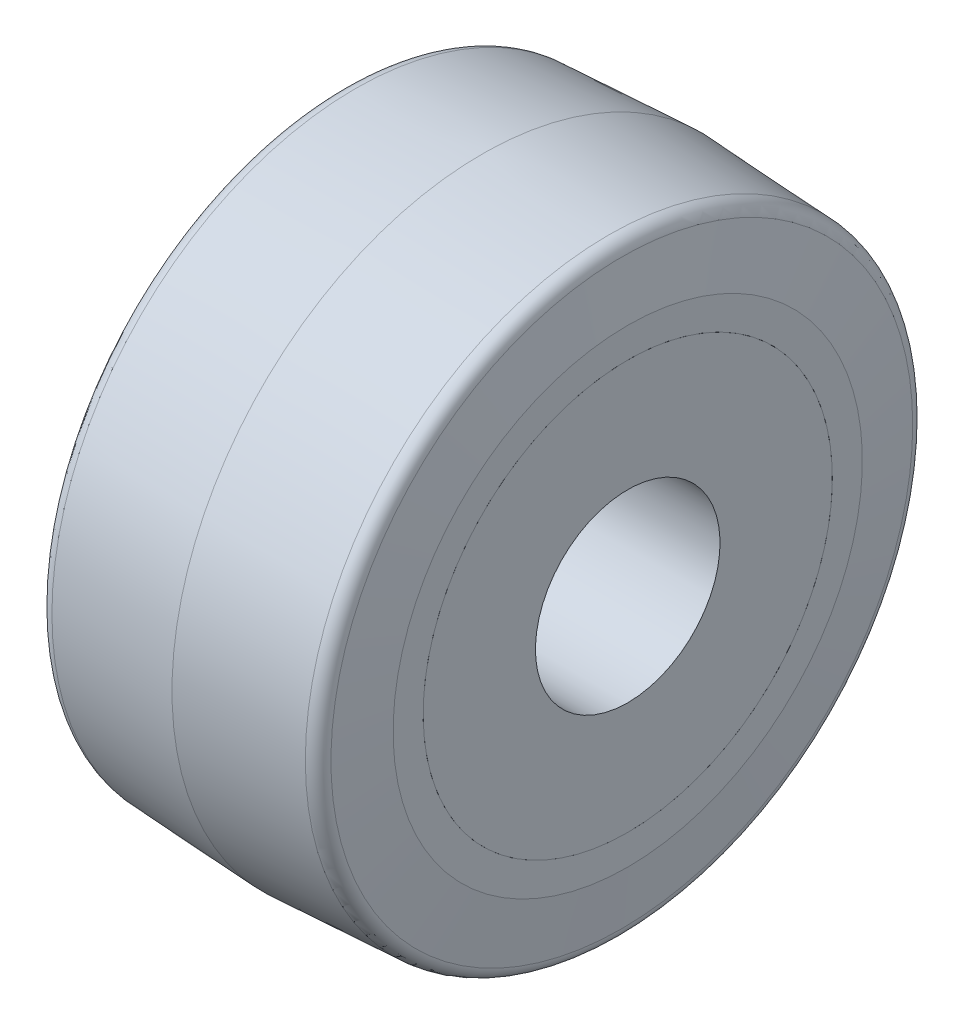
ISO-10303-21;
HEADER;
FILE_DESCRIPTION(('STEP AP214'),'2;1');
FILE_NAME('part.step','',(''),(''),'','','');
FILE_SCHEMA(('AUTOMOTIVE_DESIGN { 1 0 10303 214 1 1 1 1 }'));
ENDSEC;
DATA;
#1=APPLICATION_CONTEXT('core data for automotive mechanical design processes');
#2=APPLICATION_PROTOCOL_DEFINITION('international standard','automotive_design',2000,#1);
#3=PRODUCT_CONTEXT('',#1,'mechanical');
#4=PRODUCT('Part','Part','',(#3));
#5=PRODUCT_RELATED_PRODUCT_CATEGORY('part','',(#4));
#6=PRODUCT_DEFINITION_FORMATION('','',#4);
#7=PRODUCT_DEFINITION_CONTEXT('part definition',#1,'design');
#8=PRODUCT_DEFINITION('design','',#6,#7);
#9=PRODUCT_DEFINITION_SHAPE('','',#8);
#10=(LENGTH_UNIT() NAMED_UNIT(*) SI_UNIT(.MILLI.,.METRE.));
#11=(NAMED_UNIT(*) PLANE_ANGLE_UNIT() SI_UNIT($,.RADIAN.));
#12=(NAMED_UNIT(*) SI_UNIT($,.STERADIAN.) SOLID_ANGLE_UNIT());
#13=UNCERTAINTY_MEASURE_WITH_UNIT(LENGTH_MEASURE(1.E-05),#10,'distance_accuracy_value','');
#14=(GEOMETRIC_REPRESENTATION_CONTEXT(3) GLOBAL_UNCERTAINTY_ASSIGNED_CONTEXT((#13)) GLOBAL_UNIT_ASSIGNED_CONTEXT((#10,
#11,#12)) REPRESENTATION_CONTEXT('',''));
#15=CARTESIAN_POINT('',(0.,0.,0.));
#16=DIRECTION('',(0.,0.,1.));
#17=DIRECTION('',(1.,0.,0.));
#18=AXIS2_PLACEMENT_3D('',#15,#16,#17);
#19=CARTESIAN_POINT('',(-72.5714285714286,0.,0.));
#20=DIRECTION('',(-1.,0.,0.));
#21=DIRECTION('',(0.,0.,1.));
#22=AXIS2_PLACEMENT_3D('',#19,#20,#21);
#23=CYLINDRICAL_SURFACE('',#22,15.1257);
#24=CARTESIAN_POINT('',(23.8843486314588,0.,0.));
#25=DIRECTION('',(-1.,0.,0.));
#26=DIRECTION('',(0.,-1.,0.));
#27=AXIS2_PLACEMENT_3D('',#24,#25,#26);
#28=CIRCLE('',#27,15.1257);
#29=CARTESIAN_POINT('',(23.8843486314588,-15.1257,0.));
#30=VERTEX_POINT('',#29);
#31=EDGE_CURVE('E63',#30,#30,#28,.F.);
#32=ORIENTED_EDGE('',*,*,#31,.T.);
#33=EDGE_LOOP('',(#32));
#34=FACE_BOUND('',#33,.T.);
#35=CARTESIAN_POINT('',(-23.8843486314588,0.,0.));
#36=DIRECTION('',(1.,0.,0.));
#37=DIRECTION('',(0.,0.,-1.));
#38=AXIS2_PLACEMENT_3D('',#35,#36,#37);
#39=CIRCLE('',#38,15.1257);
#40=CARTESIAN_POINT('',(-23.8843486314588,0.,-15.1257));
#41=VERTEX_POINT('',#40);
#42=EDGE_CURVE('E54',#41,#41,#39,.F.);
#43=ORIENTED_EDGE('',*,*,#42,.T.);
#44=EDGE_LOOP('',(#43));
#45=FACE_BOUND('',#44,.T.);
#46=ADVANCED_FACE('F39',(#34,#45),#23,.F.);
#47=CARTESIAN_POINT('',(-72.5714285714286,0.,0.));
#48=DIRECTION('',(-1.,0.,0.));
#49=DIRECTION('',(0.,0.,1.));
#50=AXIS2_PLACEMENT_3D('',#47,#48,#49);
#51=CYLINDRICAL_SURFACE('',#50,33.528);
#52=CARTESIAN_POINT('',(23.8843486314588,0.,0.));
#53=DIRECTION('',(-1.,0.,0.));
#54=DIRECTION('',(0.,-1.,0.));
#55=AXIS2_PLACEMENT_3D('',#52,#53,#54);
#56=CIRCLE('',#55,33.528);
#57=CARTESIAN_POINT('',(23.8843486314588,-33.528,0.));
#58=VERTEX_POINT('',#57);
#59=EDGE_CURVE('E42',#58,#58,#56,.F.);
#60=ORIENTED_EDGE('',*,*,#59,.F.);
#61=EDGE_LOOP('',(#60));
#62=FACE_BOUND('',#61,.T.);
#63=CARTESIAN_POINT('',(19.05,0.,0.));
#64=DIRECTION('',(-1.,0.,0.));
#65=DIRECTION('',(0.,0.,1.));
#66=AXIS2_PLACEMENT_3D('',#63,#64,#65);
#67=CIRCLE('',#66,33.528);
#68=CARTESIAN_POINT('',(19.05,0.,33.528));
#69=VERTEX_POINT('',#68);
#70=EDGE_CURVE('E59',#69,#69,#67,.F.);
#71=ORIENTED_EDGE('',*,*,#70,.T.);
#72=EDGE_LOOP('',(#71));
#73=FACE_BOUND('',#72,.T.);
#74=ADVANCED_FACE('F76',(#62,#73),#51,.T.);
#75=CARTESIAN_POINT('',(-72.5714285714286,0.,0.));
#76=DIRECTION('',(-1.,0.,0.));
#77=DIRECTION('',(0.,0.,1.));
#78=AXIS2_PLACEMENT_3D('',#75,#76,#77);
#79=CYLINDRICAL_SURFACE('',#78,33.528);
#80=CARTESIAN_POINT('',(-23.8843486314588,0.,0.));
#81=DIRECTION('',(1.,0.,0.));
#82=DIRECTION('',(0.,0.,-1.));
#83=AXIS2_PLACEMENT_3D('',#80,#81,#82);
#84=CIRCLE('',#83,33.528);
#85=CARTESIAN_POINT('',(-23.8843486314588,0.,-33.528));
#86=VERTEX_POINT('',#85);
#87=EDGE_CURVE('E61',#86,#86,#84,.F.);
#88=ORIENTED_EDGE('',*,*,#87,.F.);
#89=EDGE_LOOP('',(#88));
#90=FACE_BOUND('',#89,.T.);
#91=CARTESIAN_POINT('',(-19.05,0.,0.));
#92=DIRECTION('',(-1.,0.,0.));
#93=DIRECTION('',(0.,0.,1.));
#94=AXIS2_PLACEMENT_3D('',#91,#92,#93);
#95=CIRCLE('',#94,33.528);
#96=CARTESIAN_POINT('',(-19.05,0.,33.528));
#97=VERTEX_POINT('',#96);
#98=EDGE_CURVE('E51',#97,#97,#95,.T.);
#99=ORIENTED_EDGE('',*,*,#98,.T.);
#100=EDGE_LOOP('',(#99));
#101=FACE_BOUND('',#100,.T.);
#102=ADVANCED_FACE('F79',(#90,#101),#79,.T.);
#103=CARTESIAN_POINT('',(19.05,41.148,0.));
#104=DIRECTION('',(-1.,0.,0.));
#105=DIRECTION('',(0.,0.,1.));
#106=AXIS2_PLACEMENT_3D('',#103,#104,#105);
#107=PLANE('',#106);
#108=ORIENTED_EDGE('',*,*,#70,.F.);
#109=EDGE_LOOP('',(#108));
#110=FACE_BOUND('',#109,.T.);
#111=CARTESIAN_POINT('',(19.05,0.,0.));
#112=DIRECTION('',(-1.,0.,0.));
#113=DIRECTION('',(0.,0.,1.));
#114=AXIS2_PLACEMENT_3D('',#111,#112,#113);
#115=CIRCLE('',#114,41.148);
#116=CARTESIAN_POINT('',(19.05,0.,41.148));
#117=VERTEX_POINT('',#116);
#118=EDGE_CURVE('E46',#117,#117,#115,.T.);
#119=ORIENTED_EDGE('',*,*,#118,.F.);
#120=EDGE_LOOP('',(#119));
#121=FACE_BOUND('',#120,.T.);
#122=ADVANCED_FACE('F82',(#110,#121),#107,.F.);
#123=CARTESIAN_POINT('',(-19.05,33.528,0.));
#124=DIRECTION('',(1.,0.,0.));
#125=DIRECTION('',(0.,0.,-1.));
#126=AXIS2_PLACEMENT_3D('',#123,#124,#125);
#127=PLANE('',#126);
#128=CARTESIAN_POINT('',(-19.05,0.,0.));
#129=DIRECTION('',(-1.,0.,0.));
#130=DIRECTION('',(0.,0.,1.));
#131=AXIS2_PLACEMENT_3D('',#128,#129,#130);
#132=CIRCLE('',#131,41.148);
#133=CARTESIAN_POINT('',(-19.05,0.,41.148));
#134=VERTEX_POINT('',#133);
#135=EDGE_CURVE('E11',#134,#134,#132,.F.);
#136=ORIENTED_EDGE('',*,*,#135,.F.);
#137=EDGE_LOOP('',(#136));
#138=FACE_BOUND('',#137,.T.);
#139=ORIENTED_EDGE('',*,*,#98,.F.);
#140=EDGE_LOOP('',(#139));
#141=FACE_BOUND('',#140,.T.);
#142=ADVANCED_FACE('F85',(#138,#141),#127,.F.);
#143=CARTESIAN_POINT('',(-72.5714285714286,0.,0.));
#144=DIRECTION('',(-1.,0.,0.));
#145=DIRECTION('',(0.,0.,1.));
#146=AXIS2_PLACEMENT_3D('',#143,#144,#145);
#147=CYLINDRICAL_SURFACE('',#146,41.148);
#148=ORIENTED_EDGE('',*,*,#135,.T.);
#149=EDGE_LOOP('',(#148));
#150=FACE_BOUND('',#149,.T.);
#151=ORIENTED_EDGE('',*,*,#118,.T.);
#152=EDGE_LOOP('',(#151));
#153=FACE_BOUND('',#152,.T.);
#154=ADVANCED_FACE('F89',(#150,#153),#147,.T.);
#155=CARTESIAN_POINT('',(-23.8843486314588,47.4644417861219,-76.2));
#156=DIRECTION('',(1.,0.,0.));
#157=DIRECTION('',(0.,0.,-1.));
#158=AXIS2_PLACEMENT_3D('',#155,#156,#157);
#159=PLANE('',#158);
#160=ORIENTED_EDGE('',*,*,#87,.T.);
#161=EDGE_LOOP('',(#160));
#162=FACE_BOUND('',#161,.T.);
#163=ORIENTED_EDGE('',*,*,#42,.F.);
#164=EDGE_LOOP('',(#163));
#165=FACE_BOUND('',#164,.T.);
#166=ADVANCED_FACE('F91',(#162,#165),#159,.F.);
#167=CARTESIAN_POINT('',(23.8843486314588,58.9207626230882,-76.2));
#168=DIRECTION('',(-1.,0.,0.));
#169=DIRECTION('',(0.,-1.,0.));
#170=AXIS2_PLACEMENT_3D('',#167,#168,#169);
#171=PLANE('',#170);
#172=ORIENTED_EDGE('',*,*,#59,.T.);
#173=EDGE_LOOP('',(#172));
#174=FACE_BOUND('',#173,.T.);
#175=ORIENTED_EDGE('',*,*,#31,.F.);
#176=EDGE_LOOP('',(#175));
#177=FACE_BOUND('',#176,.T.);
#178=ADVANCED_FACE('F73',(#174,#177),#171,.F.);
#179=CLOSED_SHELL('',(#46,#74,#102,#122,#142,#154,#166,#178));
#180=MANIFOLD_SOLID_BREP('B2',#179);
#181=CARTESIAN_POINT('',(20.6418818876907,0.,0.));
#182=DIRECTION('',(1.,0.,0.));
#183=DIRECTION('',(0.,0.,-1.));
#184=AXIS2_PLACEMENT_3D('',#181,#182,#183);
#185=TOROIDAL_SURFACE('',#184,47.4290676270922,2.286);
#186=CARTESIAN_POINT('',(20.7615218836621,0.,0.));
#187=DIRECTION('',(1.,0.,0.));
#188=DIRECTION('',(0.,0.,-1.));
#189=AXIS2_PLACEMENT_3D('',#186,#187,#188);
#190=CIRCLE('',#189,49.7119347435411);
#191=CARTESIAN_POINT('',(20.7615218836621,0.,-49.7119347435411));
#192=VERTEX_POINT('',#191);
#193=EDGE_CURVE('E38',#192,#192,#190,.T.);
#194=ORIENTED_EDGE('',*,*,#193,.T.);
#195=EDGE_LOOP('',(#194));
#196=FACE_BOUND('',#195,.T.);
#197=CARTESIAN_POINT('',(22.9153589405026,0.,0.));
#198=DIRECTION('',(1.,0.,0.));
#199=DIRECTION('',(0.,0.,-1.));
#200=AXIS2_PLACEMENT_3D('',#197,#198,#199);
#201=CIRCLE('',#200,47.6680196941221);
#202=CARTESIAN_POINT('',(22.9153589405026,0.,-47.6680196941221));
#203=VERTEX_POINT('',#202);
#204=EDGE_CURVE('E192',#203,#203,#201,.T.);
#205=ORIENTED_EDGE('',*,*,#204,.F.);
#206=EDGE_LOOP('',(#205));
#207=FACE_BOUND('',#206,.T.);
#208=ADVANCED_FACE('F161',(#196,#207),#185,.T.);
#209=CARTESIAN_POINT('',(20.7615218836621,0.,0.));
#210=DIRECTION('',(-1.,0.,0.));
#211=DIRECTION('',(0.,0.,1.));
#212=AXIS2_PLACEMENT_3D('',#209,#210,#211);
#213=CONICAL_SURFACE('',#212,49.7119347435411,0.0523598775598232);
#214=CARTESIAN_POINT('',(0.,0.,0.));
#215=DIRECTION('',(1.,0.,0.));
#216=DIRECTION('',(0.,0.,-1.));
#217=AXIS2_PLACEMENT_3D('',#214,#215,#216);
#218=CIRCLE('',#217,50.8);
#219=CARTESIAN_POINT('',(0.,0.,-50.8));
#220=VERTEX_POINT('',#219);
#221=EDGE_CURVE('E168',#220,#220,#218,.T.);
#222=ORIENTED_EDGE('',*,*,#221,.T.);
#223=EDGE_LOOP('',(#222));
#224=FACE_BOUND('',#223,.T.);
#225=ORIENTED_EDGE('',*,*,#193,.F.);
#226=EDGE_LOOP('',(#225));
#227=FACE_BOUND('',#226,.T.);
#228=ADVANCED_FACE('F223',(#224,#227),#213,.T.);
#229=CARTESIAN_POINT('',(0.,0.,0.));
#230=DIRECTION('',(1.,0.,0.));
#231=DIRECTION('',(0.,0.,-1.));
#232=AXIS2_PLACEMENT_3D('',#229,#230,#231);
#233=CONICAL_SURFACE('',#232,50.8,0.0523598775598232);
#234=CARTESIAN_POINT('',(-20.7615218836621,0.,0.));
#235=DIRECTION('',(1.,0.,0.));
#236=DIRECTION('',(0.,0.,-1.));
#237=AXIS2_PLACEMENT_3D('',#234,#235,#236);
#238=CIRCLE('',#237,49.7119347435411);
#239=CARTESIAN_POINT('',(-20.7615218836621,0.,-49.7119347435411));
#240=VERTEX_POINT('',#239);
#241=EDGE_CURVE('E172',#240,#240,#238,.T.);
#242=ORIENTED_EDGE('',*,*,#241,.T.);
#243=EDGE_LOOP('',(#242));
#244=FACE_BOUND('',#243,.T.);
#245=ORIENTED_EDGE('',*,*,#221,.F.);
#246=EDGE_LOOP('',(#245));
#247=FACE_BOUND('',#246,.T.);
#248=ADVANCED_FACE('F227',(#244,#247),#233,.T.);
#249=CARTESIAN_POINT('',(-20.6418818876907,0.,0.));
#250=DIRECTION('',(1.,0.,0.));
#251=DIRECTION('',(0.,0.,-1.));
#252=AXIS2_PLACEMENT_3D('',#249,#250,#251);
#253=TOROIDAL_SURFACE('',#252,47.4290676270922,2.286);
#254=CARTESIAN_POINT('',(-22.9153589405026,0.,0.));
#255=DIRECTION('',(1.,0.,0.));
#256=DIRECTION('',(0.,0.,-1.));
#257=AXIS2_PLACEMENT_3D('',#254,#255,#256);
#258=CIRCLE('',#257,47.668019694122);
#259=CARTESIAN_POINT('',(-22.9153589405026,0.,-47.668019694122));
#260=VERTEX_POINT('',#259);
#261=EDGE_CURVE('E177',#260,#260,#258,.T.);
#262=ORIENTED_EDGE('',*,*,#261,.T.);
#263=EDGE_LOOP('',(#262));
#264=FACE_BOUND('',#263,.T.);
#265=ORIENTED_EDGE('',*,*,#241,.F.);
#266=EDGE_LOOP('',(#265));
#267=FACE_BOUND('',#266,.T.);
#268=ADVANCED_FACE('F234',(#264,#267),#253,.T.);
#269=CARTESIAN_POINT('',(-22.9153589405026,0.,0.));
#270=DIRECTION('',(1.,0.,0.));
#271=DIRECTION('',(0.,0.,-1.));
#272=AXIS2_PLACEMENT_3D('',#269,#270,#271);
#273=CONICAL_SURFACE('',#272,47.668019694122,1.46607657167524);
#274=CARTESIAN_POINT('',(-23.8843486314588,0.,0.));
#275=DIRECTION('',(-1.,0.,0.));
#276=DIRECTION('',(0.,0.,1.));
#277=AXIS2_PLACEMENT_3D('',#274,#275,#276);
#278=CIRCLE('',#277,38.4486986219801);
#279=CARTESIAN_POINT('',(-23.8843486314588,0.,38.4486986219801));
#280=VERTEX_POINT('',#279);
#281=EDGE_CURVE('E195',#280,#280,#278,.T.);
#282=ORIENTED_EDGE('',*,*,#281,.F.);
#283=EDGE_LOOP('',(#282));
#284=FACE_BOUND('',#283,.T.);
#285=ORIENTED_EDGE('',*,*,#261,.F.);
#286=EDGE_LOOP('',(#285));
#287=FACE_BOUND('',#286,.T.);
#288=ADVANCED_FACE('F241',(#284,#287),#273,.T.);
#289=CARTESIAN_POINT('',(-25.4,0.,0.));
#290=DIRECTION('',(1.,0.,0.));
#291=DIRECTION('',(0.,0.,-1.));
#292=AXIS2_PLACEMENT_3D('',#289,#290,#291);
#293=CYLINDRICAL_SURFACE('',#292,33.528);
#294=CARTESIAN_POINT('',(-23.8843486314588,0.,0.));
#295=DIRECTION('',(1.,0.,0.));
#296=DIRECTION('',(0.,0.,-1.));
#297=AXIS2_PLACEMENT_3D('',#294,#295,#296);
#298=CIRCLE('',#297,33.528);
#299=CARTESIAN_POINT('',(-23.8843486314588,0.,-33.528));
#300=VERTEX_POINT('',#299);
#301=EDGE_CURVE('E164',#300,#300,#298,.T.);
#302=ORIENTED_EDGE('',*,*,#301,.F.);
#303=EDGE_LOOP('',(#302));
#304=FACE_BOUND('',#303,.T.);
#305=CARTESIAN_POINT('',(-19.05,0.,0.));
#306=DIRECTION('',(1.,0.,0.));
#307=DIRECTION('',(0.,0.,-1.));
#308=AXIS2_PLACEMENT_3D('',#305,#306,#307);
#309=CIRCLE('',#308,33.528);
#310=CARTESIAN_POINT('',(-19.05,0.,-33.528));
#311=VERTEX_POINT('',#310);
#312=EDGE_CURVE('E180',#311,#311,#309,.T.);
#313=ORIENTED_EDGE('',*,*,#312,.T.);
#314=EDGE_LOOP('',(#313));
#315=FACE_BOUND('',#314,.T.);
#316=ADVANCED_FACE('F245',(#304,#315),#293,.F.);
#317=CARTESIAN_POINT('',(-19.05,33.528,0.));
#318=DIRECTION('',(1.,0.,0.));
#319=DIRECTION('',(0.,0.,-1.));
#320=AXIS2_PLACEMENT_3D('',#317,#318,#319);
#321=PLANE('',#320);
#322=CARTESIAN_POINT('',(-19.05,0.,0.));
#323=DIRECTION('',(1.,0.,0.));
#324=DIRECTION('',(0.,0.,-1.));
#325=AXIS2_PLACEMENT_3D('',#322,#323,#324);
#326=CIRCLE('',#325,41.148);
#327=CARTESIAN_POINT('',(-19.05,0.,-41.148));
#328=VERTEX_POINT('',#327);
#329=EDGE_CURVE('E183',#328,#328,#326,.T.);
#330=ORIENTED_EDGE('',*,*,#329,.T.);
#331=EDGE_LOOP('',(#330));
#332=FACE_BOUND('',#331,.T.);
#333=ORIENTED_EDGE('',*,*,#312,.F.);
#334=EDGE_LOOP('',(#333));
#335=FACE_BOUND('',#334,.T.);
#336=ADVANCED_FACE('F249',(#332,#335),#321,.T.);
#337=CARTESIAN_POINT('',(-25.4,0.,0.));
#338=DIRECTION('',(1.,0.,0.));
#339=DIRECTION('',(0.,0.,-1.));
#340=AXIS2_PLACEMENT_3D('',#337,#338,#339);
#341=CYLINDRICAL_SURFACE('',#340,41.148);
#342=CARTESIAN_POINT('',(19.05,0.,0.));
#343=DIRECTION('',(1.,0.,0.));
#344=DIRECTION('',(0.,0.,-1.));
#345=AXIS2_PLACEMENT_3D('',#342,#343,#344);
#346=CIRCLE('',#345,41.148);
#347=CARTESIAN_POINT('',(19.05,0.,-41.148));
#348=VERTEX_POINT('',#347);
#349=EDGE_CURVE('E186',#348,#348,#346,.T.);
#350=ORIENTED_EDGE('',*,*,#349,.T.);
#351=EDGE_LOOP('',(#350));
#352=FACE_BOUND('',#351,.T.);
#353=ORIENTED_EDGE('',*,*,#329,.F.);
#354=EDGE_LOOP('',(#353));
#355=FACE_BOUND('',#354,.T.);
#356=ADVANCED_FACE('F253',(#352,#355),#341,.F.);
#357=CARTESIAN_POINT('',(19.05,41.148,0.));
#358=DIRECTION('',(-1.,0.,0.));
#359=DIRECTION('',(0.,0.,1.));
#360=AXIS2_PLACEMENT_3D('',#357,#358,#359);
#361=PLANE('',#360);
#362=CARTESIAN_POINT('',(19.05,0.,0.));
#363=DIRECTION('',(1.,0.,0.));
#364=DIRECTION('',(0.,0.,-1.));
#365=AXIS2_PLACEMENT_3D('',#362,#363,#364);
#366=CIRCLE('',#365,33.528);
#367=CARTESIAN_POINT('',(19.05,0.,-33.528));
#368=VERTEX_POINT('',#367);
#369=EDGE_CURVE('E189',#368,#368,#366,.T.);
#370=ORIENTED_EDGE('',*,*,#369,.T.);
#371=EDGE_LOOP('',(#370));
#372=FACE_BOUND('',#371,.T.);
#373=ORIENTED_EDGE('',*,*,#349,.F.);
#374=EDGE_LOOP('',(#373));
#375=FACE_BOUND('',#374,.T.);
#376=ADVANCED_FACE('F219',(#372,#375),#361,.T.);
#377=CARTESIAN_POINT('',(-25.4,0.,0.));
#378=DIRECTION('',(1.,0.,0.));
#379=DIRECTION('',(0.,0.,-1.));
#380=AXIS2_PLACEMENT_3D('',#377,#378,#379);
#381=CYLINDRICAL_SURFACE('',#380,33.528);
#382=CARTESIAN_POINT('',(23.8843486314588,0.,0.));
#383=DIRECTION('',(-1.,0.,0.));
#384=DIRECTION('',(0.,-1.,0.));
#385=AXIS2_PLACEMENT_3D('',#382,#383,#384);
#386=CIRCLE('',#385,33.528);
#387=CARTESIAN_POINT('',(23.8843486314588,-33.528,0.));
#388=VERTEX_POINT('',#387);
#389=EDGE_CURVE('E198',#388,#388,#386,.T.);
#390=ORIENTED_EDGE('',*,*,#389,.F.);
#391=EDGE_LOOP('',(#390));
#392=FACE_BOUND('',#391,.T.);
#393=ORIENTED_EDGE('',*,*,#369,.F.);
#394=EDGE_LOOP('',(#393));
#395=FACE_BOUND('',#394,.T.);
#396=ADVANCED_FACE('F210',(#392,#395),#381,.F.);
#397=CARTESIAN_POINT('',(23.8843486314588,0.,0.));
#398=DIRECTION('',(-1.,0.,0.));
#399=DIRECTION('',(0.,0.,1.));
#400=AXIS2_PLACEMENT_3D('',#397,#398,#399);
#401=CONICAL_SURFACE('',#400,38.4486986219801,1.46607657167524);
#402=ORIENTED_EDGE('',*,*,#204,.T.);
#403=EDGE_LOOP('',(#402));
#404=FACE_BOUND('',#403,.T.);
#405=CARTESIAN_POINT('',(23.8843486314588,0.,0.));
#406=DIRECTION('',(-1.,0.,0.));
#407=DIRECTION('',(0.,-1.,0.));
#408=AXIS2_PLACEMENT_3D('',#405,#406,#407);
#409=CIRCLE('',#408,38.44869862198);
#410=CARTESIAN_POINT('',(23.8843486314588,-38.4486986219801,0.));
#411=VERTEX_POINT('',#410);
#412=EDGE_CURVE('E201',#411,#411,#409,.F.);
#413=ORIENTED_EDGE('',*,*,#412,.F.);
#414=EDGE_LOOP('',(#413));
#415=FACE_BOUND('',#414,.T.);
#416=ADVANCED_FACE('F207',(#404,#415),#401,.T.);
#417=CARTESIAN_POINT('',(-23.8843486314588,47.4644417861219,-76.2));
#418=DIRECTION('',(1.,0.,0.));
#419=DIRECTION('',(0.,0.,-1.));
#420=AXIS2_PLACEMENT_3D('',#417,#418,#419);
#421=PLANE('',#420);
#422=ORIENTED_EDGE('',*,*,#281,.T.);
#423=EDGE_LOOP('',(#422));
#424=FACE_BOUND('',#423,.T.);
#425=ORIENTED_EDGE('',*,*,#301,.T.);
#426=EDGE_LOOP('',(#425));
#427=FACE_BOUND('',#426,.T.);
#428=ADVANCED_FACE('F209',(#424,#427),#421,.F.);
#429=CARTESIAN_POINT('',(23.8843486314588,58.9207626230882,-76.2));
#430=DIRECTION('',(-1.,0.,0.));
#431=DIRECTION('',(0.,-1.,0.));
#432=AXIS2_PLACEMENT_3D('',#429,#430,#431);
#433=PLANE('',#432);
#434=ORIENTED_EDGE('',*,*,#389,.T.);
#435=EDGE_LOOP('',(#434));
#436=FACE_BOUND('',#435,.T.);
#437=ORIENTED_EDGE('',*,*,#412,.T.);
#438=EDGE_LOOP('',(#437));
#439=FACE_BOUND('',#438,.T.);
#440=ADVANCED_FACE('F205',(#436,#439),#433,.F.);
#441=CLOSED_SHELL('',(#208,#228,#248,#268,#288,#316,#336,#356,#376,#396,#416,#428,#440));
#442=MANIFOLD_SOLID_BREP('B6',#441);
#443=ADVANCED_BREP_SHAPE_REPRESENTATION('',(#18,#180,#442),#14);
#444=SHAPE_DEFINITION_REPRESENTATION(#9,#443);
ENDSEC;
END-ISO-10303-21;
